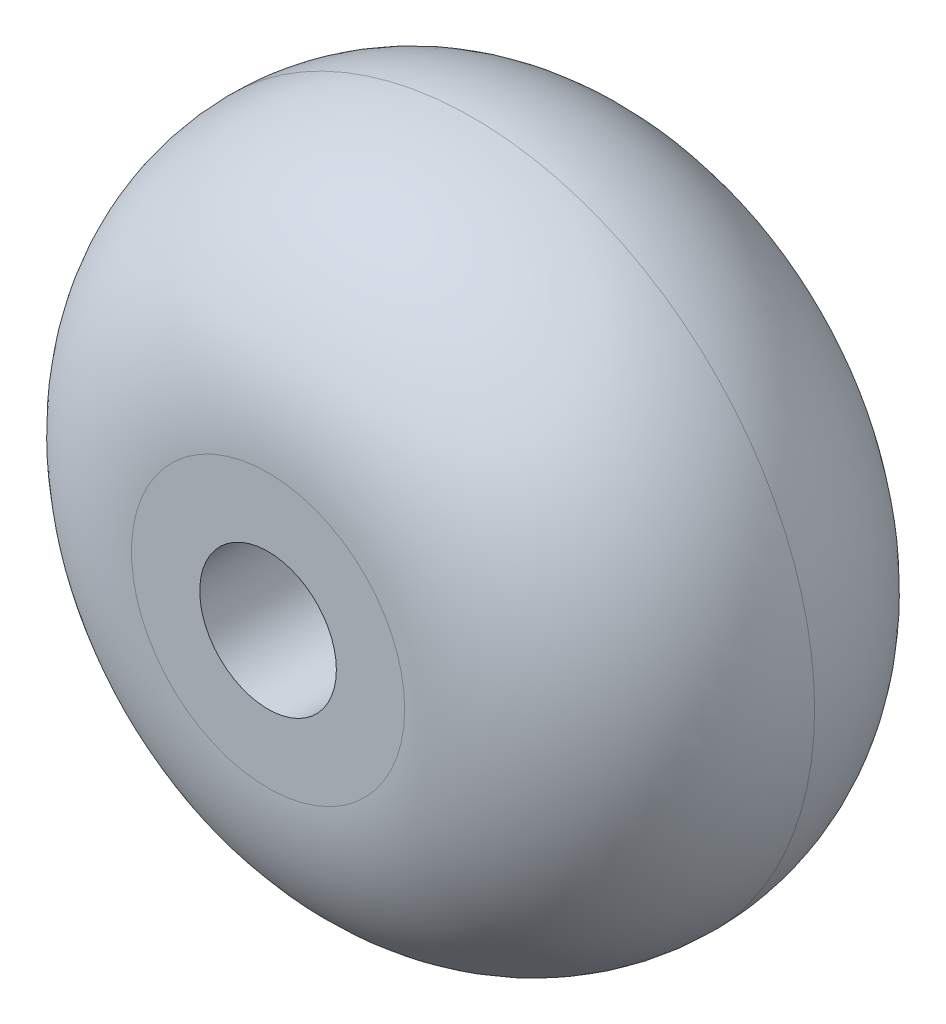
ISO-10303-21;
HEADER;
FILE_DESCRIPTION(('STEP AP214'),'2;1');
FILE_NAME('part.step','',(''),(''),'','','');
FILE_SCHEMA(('AUTOMOTIVE_DESIGN { 1 0 10303 214 1 1 1 1 }'));
ENDSEC;
DATA;
#1=APPLICATION_CONTEXT('core data for automotive mechanical design processes');
#2=APPLICATION_PROTOCOL_DEFINITION('international standard','automotive_design',2000,#1);
#3=PRODUCT_CONTEXT('',#1,'mechanical');
#4=PRODUCT('Part','Part','',(#3));
#5=PRODUCT_RELATED_PRODUCT_CATEGORY('part','',(#4));
#6=PRODUCT_DEFINITION_FORMATION('','',#4);
#7=PRODUCT_DEFINITION_CONTEXT('part definition',#1,'design');
#8=PRODUCT_DEFINITION('design','',#6,#7);
#9=PRODUCT_DEFINITION_SHAPE('','',#8);
#10=(LENGTH_UNIT() NAMED_UNIT(*) SI_UNIT(.MILLI.,.METRE.));
#11=(NAMED_UNIT(*) PLANE_ANGLE_UNIT() SI_UNIT($,.RADIAN.));
#12=(NAMED_UNIT(*) SI_UNIT($,.STERADIAN.) SOLID_ANGLE_UNIT());
#13=UNCERTAINTY_MEASURE_WITH_UNIT(LENGTH_MEASURE(1.E-05),#10,'distance_accuracy_value','');
#14=(GEOMETRIC_REPRESENTATION_CONTEXT(3) GLOBAL_UNCERTAINTY_ASSIGNED_CONTEXT((#13)) GLOBAL_UNIT_ASSIGNED_CONTEXT((#10,
#11,#12)) REPRESENTATION_CONTEXT('',''));
#15=CARTESIAN_POINT('',(0.,0.,0.));
#16=DIRECTION('',(0.,0.,1.));
#17=DIRECTION('',(1.,0.,0.));
#18=AXIS2_PLACEMENT_3D('',#15,#16,#17);
#19=CARTESIAN_POINT('',(0.,0.,30.));
#20=DIRECTION('',(0.,0.,1.));
#21=DIRECTION('',(1.,0.,0.));
#22=AXIS2_PLACEMENT_3D('',#19,#20,#21);
#23=PLANE('',#22);
#24=CARTESIAN_POINT('',(0.,0.,30.));
#25=DIRECTION('',(0.,0.,1.));
#26=DIRECTION('',(1.,0.,0.));
#27=AXIS2_PLACEMENT_3D('',#24,#25,#26);
#28=CIRCLE('',#27,10.);
#29=CARTESIAN_POINT('',(10.,0.,30.));
#30=VERTEX_POINT('',#29);
#31=EDGE_CURVE('E10',#30,#30,#28,.T.);
#32=ORIENTED_EDGE('',*,*,#31,.T.);
#33=EDGE_LOOP('',(#32));
#34=FACE_BOUND('',#33,.T.);
#35=CARTESIAN_POINT('',(0.,0.,30.));
#36=DIRECTION('',(0.,0.,1.));
#37=DIRECTION('',(1.,0.,0.));
#38=AXIS2_PLACEMENT_3D('',#35,#36,#37);
#39=CIRCLE('',#38,5.);
#40=CARTESIAN_POINT('',(5.,0.,30.));
#41=VERTEX_POINT('',#40);
#42=EDGE_CURVE('E54',#41,#41,#39,.T.);
#43=ORIENTED_EDGE('',*,*,#42,.F.);
#44=EDGE_LOOP('',(#43));
#45=FACE_BOUND('',#44,.T.);
#46=ADVANCED_FACE('F36',(#34,#45),#23,.T.);
#47=CARTESIAN_POINT('',(0.,0.,0.));
#48=DIRECTION('',(0.,0.,1.));
#49=DIRECTION('',(1.,0.,0.));
#50=AXIS2_PLACEMENT_3D('',#47,#48,#49);
#51=PLANE('',#50);
#52=CARTESIAN_POINT('',(0.,0.,0.));
#53=DIRECTION('',(0.,0.,1.));
#54=DIRECTION('',(1.,0.,0.));
#55=AXIS2_PLACEMENT_3D('',#52,#53,#54);
#56=CIRCLE('',#55,10.);
#57=CARTESIAN_POINT('',(10.,0.,0.));
#58=VERTEX_POINT('',#57);
#59=EDGE_CURVE('E45',#58,#58,#56,.F.);
#60=ORIENTED_EDGE('',*,*,#59,.T.);
#61=EDGE_LOOP('',(#60));
#62=FACE_BOUND('',#61,.T.);
#63=CARTESIAN_POINT('',(0.,0.,0.));
#64=DIRECTION('',(0.,0.,1.));
#65=DIRECTION('',(1.,0.,0.));
#66=AXIS2_PLACEMENT_3D('',#63,#64,#65);
#67=CIRCLE('',#66,5.);
#68=CARTESIAN_POINT('',(5.,0.,0.));
#69=VERTEX_POINT('',#68);
#70=EDGE_CURVE('E51',#69,#69,#67,.T.);
#71=ORIENTED_EDGE('',*,*,#70,.T.);
#72=EDGE_LOOP('',(#71));
#73=FACE_BOUND('',#72,.T.);
#74=ADVANCED_FACE('F63',(#62,#73),#51,.F.);
#75=CARTESIAN_POINT('',(0.,0.,0.));
#76=DIRECTION('',(0.,0.,1.));
#77=DIRECTION('',(1.,0.,0.));
#78=AXIS2_PLACEMENT_3D('',#75,#76,#77);
#79=CYLINDRICAL_SURFACE('',#78,5.);
#80=ORIENTED_EDGE('',*,*,#70,.F.);
#81=EDGE_LOOP('',(#80));
#82=FACE_BOUND('',#81,.T.);
#83=ORIENTED_EDGE('',*,*,#42,.T.);
#84=EDGE_LOOP('',(#83));
#85=FACE_BOUND('',#84,.T.);
#86=ADVANCED_FACE('F65',(#82,#85),#79,.F.);
#87=CARTESIAN_POINT('',(0.,0.,15.));
#88=DIRECTION('',(0.,0.,1.));
#89=DIRECTION('',(1.,0.,0.));
#90=AXIS2_PLACEMENT_3D('',#87,#88,#89);
#91=DEGENERATE_TOROIDAL_SURFACE('',#90,10.,15.,.T.);
#92=ORIENTED_EDGE('',*,*,#31,.F.);
#93=EDGE_LOOP('',(#92));
#94=FACE_BOUND('',#93,.T.);
#95=CARTESIAN_POINT('',(0.,0.,15.));
#96=DIRECTION('',(0.,0.,1.));
#97=DIRECTION('',(1.,0.,0.));
#98=AXIS2_PLACEMENT_3D('',#95,#96,#97);
#99=CIRCLE('',#98,25.);
#100=CARTESIAN_POINT('',(25.,0.,15.));
#101=VERTEX_POINT('',#100);
#102=EDGE_CURVE('E40',#101,#101,#99,.F.);
#103=ORIENTED_EDGE('',*,*,#102,.F.);
#104=EDGE_LOOP('',(#103));
#105=FACE_BOUND('',#104,.T.);
#106=ADVANCED_FACE('F38',(#94,#105),#91,.T.);
#107=CARTESIAN_POINT('',(0.,0.,15.));
#108=DIRECTION('',(0.,0.,1.));
#109=DIRECTION('',(1.,0.,0.));
#110=AXIS2_PLACEMENT_3D('',#107,#108,#109);
#111=DEGENERATE_TOROIDAL_SURFACE('',#110,10.,15.,.T.);
#112=ORIENTED_EDGE('',*,*,#59,.F.);
#113=EDGE_LOOP('',(#112));
#114=FACE_BOUND('',#113,.T.);
#115=ORIENTED_EDGE('',*,*,#102,.T.);
#116=EDGE_LOOP('',(#115));
#117=FACE_BOUND('',#116,.T.);
#118=ADVANCED_FACE('F78',(#114,#117),#111,.T.);
#119=CLOSED_SHELL('',(#46,#74,#86,#106,#118));
#120=MANIFOLD_SOLID_BREP('B2',#119);
#121=ADVANCED_BREP_SHAPE_REPRESENTATION('',(#18,#120),#14);
#122=SHAPE_DEFINITION_REPRESENTATION(#9,#121);
ENDSEC;
END-ISO-10303-21;
